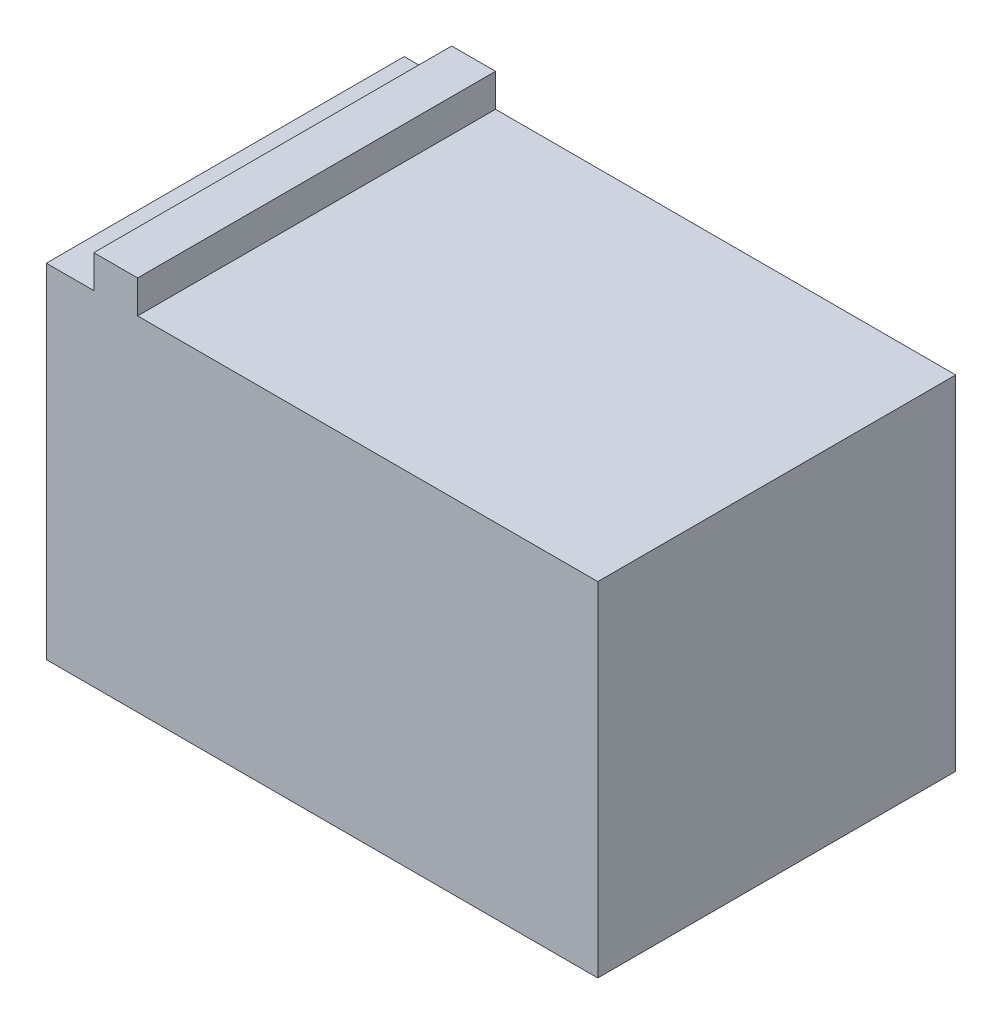
ISO-10303-21;
HEADER;
FILE_DESCRIPTION(('STEP AP214'),'2;1');
FILE_NAME('part.step','',(''),(''),'','','');
FILE_SCHEMA(('AUTOMOTIVE_DESIGN { 1 0 10303 214 1 1 1 1 }'));
ENDSEC;
DATA;
#1=APPLICATION_CONTEXT('core data for automotive mechanical design processes');
#2=APPLICATION_PROTOCOL_DEFINITION('international standard','automotive_design',2000,#1);
#3=PRODUCT_CONTEXT('',#1,'mechanical');
#4=PRODUCT('Part','Part','',(#3));
#5=PRODUCT_RELATED_PRODUCT_CATEGORY('part','',(#4));
#6=PRODUCT_DEFINITION_FORMATION('','',#4);
#7=PRODUCT_DEFINITION_CONTEXT('part definition',#1,'design');
#8=PRODUCT_DEFINITION('design','',#6,#7);
#9=PRODUCT_DEFINITION_SHAPE('','',#8);
#10=(LENGTH_UNIT() NAMED_UNIT(*) SI_UNIT(.MILLI.,.METRE.));
#11=(NAMED_UNIT(*) PLANE_ANGLE_UNIT() SI_UNIT($,.RADIAN.));
#12=(NAMED_UNIT(*) SI_UNIT($,.STERADIAN.) SOLID_ANGLE_UNIT());
#13=UNCERTAINTY_MEASURE_WITH_UNIT(LENGTH_MEASURE(1.E-05),#10,'distance_accuracy_value','');
#14=(GEOMETRIC_REPRESENTATION_CONTEXT(3) GLOBAL_UNCERTAINTY_ASSIGNED_CONTEXT((#13)) GLOBAL_UNIT_ASSIGNED_CONTEXT((#10,
#11,#12)) REPRESENTATION_CONTEXT('',''));
#15=CARTESIAN_POINT('',(0.,0.,0.));
#16=DIRECTION('',(0.,0.,1.));
#17=DIRECTION('',(1.,0.,0.));
#18=AXIS2_PLACEMENT_3D('',#15,#16,#17);
#19=CARTESIAN_POINT('',(0.,94.,0.));
#20=DIRECTION('',(0.,-1.,0.));
#21=DIRECTION('',(0.,0.,-1.));
#22=AXIS2_PLACEMENT_3D('',#19,#20,#21);
#23=PLANE('',#22);
#24=DIRECTION('',(0.,0.,1.));
#25=VECTOR('',#24,1.);
#26=CARTESIAN_POINT('',(-62.5,94.,-49.));
#27=LINE('',#26,#25);
#28=CARTESIAN_POINT('',(-62.5,94.,-49.));
#29=VERTEX_POINT('',#28);
#30=CARTESIAN_POINT('',(-62.5,94.,49.));
#31=VERTEX_POINT('',#30);
#32=EDGE_CURVE('E122',#29,#31,#27,.T.);
#33=ORIENTED_EDGE('',*,*,#32,.F.);
#34=DIRECTION('',(-1.,0.,0.));
#35=VECTOR('',#34,1.);
#36=CARTESIAN_POINT('',(-75.5,94.,-49.));
#37=LINE('',#36,#35);
#38=CARTESIAN_POINT('',(-75.5,94.,-49.));
#39=VERTEX_POINT('',#38);
#40=EDGE_CURVE('E135',#29,#39,#37,.T.);
#41=ORIENTED_EDGE('',*,*,#40,.T.);
#42=DIRECTION('',(0.,0.,1.));
#43=VECTOR('',#42,1.);
#44=CARTESIAN_POINT('',(-75.5,94.,49.));
#45=LINE('',#44,#43);
#46=CARTESIAN_POINT('',(-75.5,94.,49.));
#47=VERTEX_POINT('',#46);
#48=EDGE_CURVE('E139',#39,#47,#45,.T.);
#49=ORIENTED_EDGE('',*,*,#48,.T.);
#50=DIRECTION('',(1.,0.,0.));
#51=VECTOR('',#50,1.);
#52=CARTESIAN_POINT('',(-75.5,94.,49.));
#53=LINE('',#52,#51);
#54=EDGE_CURVE('E59',#47,#31,#53,.T.);
#55=ORIENTED_EDGE('',*,*,#54,.T.);
#56=EDGE_LOOP('',(#33,#41,#49,#55));
#57=FACE_BOUND('',#56,.T.);
#58=ADVANCED_FACE('F36',(#57),#23,.F.);
#59=DIRECTION('',(0.,0.,-1.));
#60=VECTOR('',#59,1.);
#61=CARTESIAN_POINT('',(-50.5,94.,-49.));
#62=LINE('',#61,#60);
#63=CARTESIAN_POINT('',(-50.5,94.,49.));
#64=VERTEX_POINT('',#63);
#65=CARTESIAN_POINT('',(-50.5,94.,-49.));
#66=VERTEX_POINT('',#65);
#67=EDGE_CURVE('E51',#64,#66,#62,.T.);
#68=ORIENTED_EDGE('',*,*,#67,.F.);
#69=CARTESIAN_POINT('',(75.5,94.,49.));
#70=VERTEX_POINT('',#69);
#71=EDGE_CURVE('E141',#64,#70,#53,.T.);
#72=ORIENTED_EDGE('',*,*,#71,.T.);
#73=DIRECTION('',(0.,0.,-1.));
#74=VECTOR('',#73,1.);
#75=CARTESIAN_POINT('',(75.5,94.,49.));
#76=LINE('',#75,#74);
#77=CARTESIAN_POINT('',(75.5,94.,-49.));
#78=VERTEX_POINT('',#77);
#79=EDGE_CURVE('E132',#70,#78,#76,.T.);
#80=ORIENTED_EDGE('',*,*,#79,.T.);
#81=EDGE_CURVE('E137',#78,#66,#37,.T.);
#82=ORIENTED_EDGE('',*,*,#81,.T.);
#83=EDGE_LOOP('',(#68,#72,#80,#82));
#84=FACE_BOUND('',#83,.T.);
#85=ADVANCED_FACE('F169',(#84),#23,.F.);
#86=CARTESIAN_POINT('',(75.5,94.,49.));
#87=DIRECTION('',(-1.,0.,0.));
#88=DIRECTION('',(0.,0.,1.));
#89=AXIS2_PLACEMENT_3D('',#86,#87,#88);
#90=PLANE('',#89);
#91=DIRECTION('',(0.,0.,-1.));
#92=VECTOR('',#91,1.);
#93=CARTESIAN_POINT('',(75.5,0.,49.));
#94=LINE('',#93,#92);
#95=CARTESIAN_POINT('',(75.5,0.,49.));
#96=VERTEX_POINT('',#95);
#97=CARTESIAN_POINT('',(75.5,0.,-49.));
#98=VERTEX_POINT('',#97);
#99=EDGE_CURVE('E123',#96,#98,#94,.T.);
#100=ORIENTED_EDGE('',*,*,#99,.T.);
#101=DIRECTION('',(0.,-1.,0.));
#102=VECTOR('',#101,1.);
#103=CARTESIAN_POINT('',(75.5,94.,-49.));
#104=LINE('',#103,#102);
#105=EDGE_CURVE('E11',#78,#98,#104,.T.);
#106=ORIENTED_EDGE('',*,*,#105,.F.);
#107=ORIENTED_EDGE('',*,*,#79,.F.);
#108=DIRECTION('',(0.,-1.,0.));
#109=VECTOR('',#108,1.);
#110=CARTESIAN_POINT('',(75.5,94.,49.));
#111=LINE('',#110,#109);
#112=EDGE_CURVE('E142',#70,#96,#111,.T.);
#113=ORIENTED_EDGE('',*,*,#112,.T.);
#114=EDGE_LOOP('',(#100,#106,#107,#113));
#115=FACE_BOUND('',#114,.T.);
#116=ADVANCED_FACE('F38',(#115),#90,.F.);
#117=CARTESIAN_POINT('',(-75.5,94.,-49.));
#118=DIRECTION('',(0.,0.,1.));
#119=DIRECTION('',(1.,0.,0.));
#120=AXIS2_PLACEMENT_3D('',#117,#118,#119);
#121=PLANE('',#120);
#122=DIRECTION('',(-1.,0.,0.));
#123=VECTOR('',#122,1.);
#124=CARTESIAN_POINT('',(-75.5,0.,-49.));
#125=LINE('',#124,#123);
#126=CARTESIAN_POINT('',(-75.5,0.,-49.));
#127=VERTEX_POINT('',#126);
#128=EDGE_CURVE('E126',#98,#127,#125,.T.);
#129=ORIENTED_EDGE('',*,*,#128,.T.);
#130=DIRECTION('',(0.,-1.,0.));
#131=VECTOR('',#130,1.);
#132=CARTESIAN_POINT('',(-75.5,94.,-49.));
#133=LINE('',#132,#131);
#134=EDGE_CURVE('E44',#39,#127,#133,.T.);
#135=ORIENTED_EDGE('',*,*,#134,.F.);
#136=ORIENTED_EDGE('',*,*,#40,.F.);
#137=DIRECTION('',(0.,-1.,0.));
#138=VECTOR('',#137,1.);
#139=CARTESIAN_POINT('',(-62.5,103.,-49.));
#140=LINE('',#139,#138);
#141=CARTESIAN_POINT('',(-62.5,103.,-49.));
#142=VERTEX_POINT('',#141);
#143=EDGE_CURVE('E175',#142,#29,#140,.T.);
#144=ORIENTED_EDGE('',*,*,#143,.F.);
#145=DIRECTION('',(-1.,0.,0.));
#146=VECTOR('',#145,1.);
#147=CARTESIAN_POINT('',(-62.5,103.,-49.));
#148=LINE('',#147,#146);
#149=CARTESIAN_POINT('',(-50.5,103.,-49.));
#150=VERTEX_POINT('',#149);
#151=EDGE_CURVE('E116',#150,#142,#148,.T.);
#152=ORIENTED_EDGE('',*,*,#151,.F.);
#153=DIRECTION('',(0.,-1.,0.));
#154=VECTOR('',#153,1.);
#155=CARTESIAN_POINT('',(-50.5,103.,-49.));
#156=LINE('',#155,#154);
#157=EDGE_CURVE('E128',#150,#66,#156,.T.);
#158=ORIENTED_EDGE('',*,*,#157,.T.);
#159=ORIENTED_EDGE('',*,*,#81,.F.);
#160=ORIENTED_EDGE('',*,*,#105,.T.);
#161=EDGE_LOOP('',(#129,#135,#136,#144,#152,#158,#159,#160));
#162=FACE_BOUND('',#161,.T.);
#163=ADVANCED_FACE('F180',(#162),#121,.F.);
#164=CARTESIAN_POINT('',(-75.5,94.,49.));
#165=DIRECTION('',(1.,0.,0.));
#166=DIRECTION('',(0.,0.,-1.));
#167=AXIS2_PLACEMENT_3D('',#164,#165,#166);
#168=PLANE('',#167);
#169=DIRECTION('',(0.,0.,1.));
#170=VECTOR('',#169,1.);
#171=CARTESIAN_POINT('',(-75.5,0.,49.));
#172=LINE('',#171,#170);
#173=CARTESIAN_POINT('',(-75.5,0.,49.));
#174=VERTEX_POINT('',#173);
#175=EDGE_CURVE('E145',#127,#174,#172,.T.);
#176=ORIENTED_EDGE('',*,*,#175,.T.);
#177=DIRECTION('',(0.,-1.,0.));
#178=VECTOR('',#177,1.);
#179=CARTESIAN_POINT('',(-75.5,94.,49.));
#180=LINE('',#179,#178);
#181=EDGE_CURVE('E150',#47,#174,#180,.T.);
#182=ORIENTED_EDGE('',*,*,#181,.F.);
#183=ORIENTED_EDGE('',*,*,#48,.F.);
#184=ORIENTED_EDGE('',*,*,#134,.T.);
#185=EDGE_LOOP('',(#176,#182,#183,#184));
#186=FACE_BOUND('',#185,.T.);
#187=ADVANCED_FACE('F157',(#186),#168,.F.);
#188=CARTESIAN_POINT('',(-75.5,94.,49.));
#189=DIRECTION('',(0.,0.,-1.));
#190=DIRECTION('',(-1.,0.,0.));
#191=AXIS2_PLACEMENT_3D('',#188,#189,#190);
#192=PLANE('',#191);
#193=DIRECTION('',(1.,0.,0.));
#194=VECTOR('',#193,1.);
#195=CARTESIAN_POINT('',(-75.5,0.,49.));
#196=LINE('',#195,#194);
#197=EDGE_CURVE('E136',#174,#96,#196,.T.);
#198=ORIENTED_EDGE('',*,*,#197,.T.);
#199=ORIENTED_EDGE('',*,*,#112,.F.);
#200=ORIENTED_EDGE('',*,*,#71,.F.);
#201=DIRECTION('',(0.,-1.,0.));
#202=VECTOR('',#201,1.);
#203=CARTESIAN_POINT('',(-50.5,103.,49.));
#204=LINE('',#203,#202);
#205=CARTESIAN_POINT('',(-50.5,103.,49.));
#206=VERTEX_POINT('',#205);
#207=EDGE_CURVE('E107',#206,#64,#204,.T.);
#208=ORIENTED_EDGE('',*,*,#207,.F.);
#209=DIRECTION('',(1.,0.,0.));
#210=VECTOR('',#209,1.);
#211=CARTESIAN_POINT('',(-62.5,103.,49.));
#212=LINE('',#211,#210);
#213=CARTESIAN_POINT('',(-62.5,103.,49.));
#214=VERTEX_POINT('',#213);
#215=EDGE_CURVE('E100',#214,#206,#212,.T.);
#216=ORIENTED_EDGE('',*,*,#215,.F.);
#217=DIRECTION('',(0.,-1.,0.));
#218=VECTOR('',#217,1.);
#219=CARTESIAN_POINT('',(-62.5,103.,49.));
#220=LINE('',#219,#218);
#221=EDGE_CURVE('E104',#214,#31,#220,.T.);
#222=ORIENTED_EDGE('',*,*,#221,.T.);
#223=ORIENTED_EDGE('',*,*,#54,.F.);
#224=ORIENTED_EDGE('',*,*,#181,.T.);
#225=EDGE_LOOP('',(#198,#199,#200,#208,#216,#222,#223,#224));
#226=FACE_BOUND('',#225,.T.);
#227=ADVANCED_FACE('F102',(#226),#192,.F.);
#228=CARTESIAN_POINT('',(0.,0.,0.));
#229=DIRECTION('',(0.,-1.,0.));
#230=DIRECTION('',(0.,0.,-1.));
#231=AXIS2_PLACEMENT_3D('',#228,#229,#230);
#232=PLANE('',#231);
#233=ORIENTED_EDGE('',*,*,#99,.F.);
#234=ORIENTED_EDGE('',*,*,#197,.F.);
#235=ORIENTED_EDGE('',*,*,#175,.F.);
#236=ORIENTED_EDGE('',*,*,#128,.F.);
#237=EDGE_LOOP('',(#233,#234,#235,#236));
#238=FACE_BOUND('',#237,.T.);
#239=ADVANCED_FACE('F164',(#238),#232,.T.);
#240=CARTESIAN_POINT('',(-62.5,103.,-49.));
#241=DIRECTION('',(1.,0.,0.));
#242=DIRECTION('',(0.,0.,-1.));
#243=AXIS2_PLACEMENT_3D('',#240,#241,#242);
#244=PLANE('',#243);
#245=ORIENTED_EDGE('',*,*,#32,.T.);
#246=ORIENTED_EDGE('',*,*,#221,.F.);
#247=DIRECTION('',(0.,0.,1.));
#248=VECTOR('',#247,1.);
#249=CARTESIAN_POINT('',(-62.5,103.,-49.));
#250=LINE('',#249,#248);
#251=EDGE_CURVE('E111',#142,#214,#250,.T.);
#252=ORIENTED_EDGE('',*,*,#251,.F.);
#253=ORIENTED_EDGE('',*,*,#143,.T.);
#254=EDGE_LOOP('',(#245,#246,#252,#253));
#255=FACE_BOUND('',#254,.T.);
#256=ADVANCED_FACE('F121',(#255),#244,.F.);
#257=CARTESIAN_POINT('',(-50.5,103.,-49.));
#258=DIRECTION('',(-1.,0.,0.));
#259=DIRECTION('',(0.,0.,1.));
#260=AXIS2_PLACEMENT_3D('',#257,#258,#259);
#261=PLANE('',#260);
#262=ORIENTED_EDGE('',*,*,#67,.T.);
#263=ORIENTED_EDGE('',*,*,#157,.F.);
#264=DIRECTION('',(0.,0.,-1.));
#265=VECTOR('',#264,1.);
#266=CARTESIAN_POINT('',(-50.5,103.,-49.));
#267=LINE('',#266,#265);
#268=EDGE_CURVE('E110',#206,#150,#267,.T.);
#269=ORIENTED_EDGE('',*,*,#268,.F.);
#270=ORIENTED_EDGE('',*,*,#207,.T.);
#271=EDGE_LOOP('',(#262,#263,#269,#270));
#272=FACE_BOUND('',#271,.T.);
#273=ADVANCED_FACE('F171',(#272),#261,.F.);
#274=CARTESIAN_POINT('',(0.,103.,0.));
#275=DIRECTION('',(0.,1.,0.));
#276=DIRECTION('',(0.,0.,1.));
#277=AXIS2_PLACEMENT_3D('',#274,#275,#276);
#278=PLANE('',#277);
#279=ORIENTED_EDGE('',*,*,#251,.T.);
#280=ORIENTED_EDGE('',*,*,#215,.T.);
#281=ORIENTED_EDGE('',*,*,#268,.T.);
#282=ORIENTED_EDGE('',*,*,#151,.T.);
#283=EDGE_LOOP('',(#279,#280,#281,#282));
#284=FACE_BOUND('',#283,.T.);
#285=ADVANCED_FACE('F114',(#284),#278,.T.);
#286=CLOSED_SHELL('',(#58,#85,#116,#163,#187,#227,#239,#256,#273,#285));
#287=MANIFOLD_SOLID_BREP('B2',#286);
#288=ADVANCED_BREP_SHAPE_REPRESENTATION('',(#18,#287),#14);
#289=SHAPE_DEFINITION_REPRESENTATION(#9,#288);
ENDSEC;
END-ISO-10303-21;
